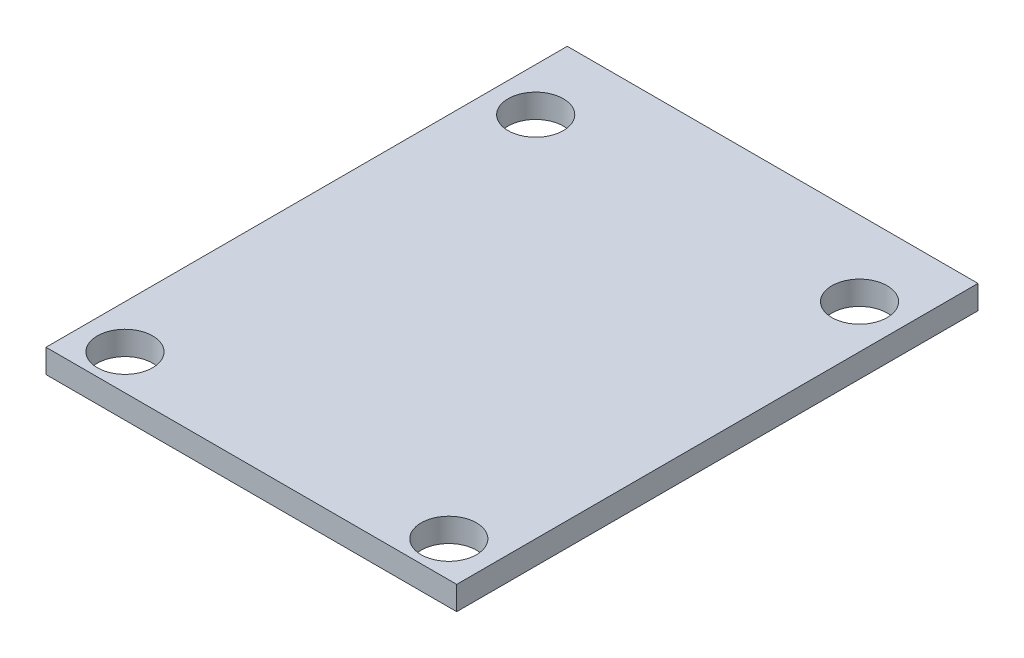
ISO-10303-21;
HEADER;
FILE_DESCRIPTION(('STEP AP214'),'2;1');
FILE_NAME('part.step','',(''),(''),'','','');
FILE_SCHEMA(('AUTOMOTIVE_DESIGN { 1 0 10303 214 1 1 1 1 }'));
ENDSEC;
DATA;
#1=APPLICATION_CONTEXT('core data for automotive mechanical design processes');
#2=APPLICATION_PROTOCOL_DEFINITION('international standard','automotive_design',2000,#1);
#3=PRODUCT_CONTEXT('',#1,'mechanical');
#4=PRODUCT('Part','Part','',(#3));
#5=PRODUCT_RELATED_PRODUCT_CATEGORY('part','',(#4));
#6=PRODUCT_DEFINITION_FORMATION('','',#4);
#7=PRODUCT_DEFINITION_CONTEXT('part definition',#1,'design');
#8=PRODUCT_DEFINITION('design','',#6,#7);
#9=PRODUCT_DEFINITION_SHAPE('','',#8);
#10=(LENGTH_UNIT() NAMED_UNIT(*) SI_UNIT(.MILLI.,.METRE.));
#11=(NAMED_UNIT(*) PLANE_ANGLE_UNIT() SI_UNIT($,.RADIAN.));
#12=(NAMED_UNIT(*) SI_UNIT($,.STERADIAN.) SOLID_ANGLE_UNIT());
#13=UNCERTAINTY_MEASURE_WITH_UNIT(LENGTH_MEASURE(1.E-05),#10,'distance_accuracy_value','');
#14=(GEOMETRIC_REPRESENTATION_CONTEXT(3) GLOBAL_UNCERTAINTY_ASSIGNED_CONTEXT((#13)) GLOBAL_UNIT_ASSIGNED_CONTEXT((#10,
#11,#12)) REPRESENTATION_CONTEXT('',''));
#15=CARTESIAN_POINT('',(0.,0.,0.));
#16=DIRECTION('',(0.,0.,1.));
#17=DIRECTION('',(1.,0.,0.));
#18=AXIS2_PLACEMENT_3D('',#15,#16,#17);
#19=CARTESIAN_POINT('',(13.,1.5,0.));
#20=DIRECTION('',(1.,0.,0.));
#21=DIRECTION('',(0.,0.,-1.));
#22=AXIS2_PLACEMENT_3D('',#19,#20,#21);
#23=PLANE('',#22);
#24=DIRECTION('',(0.,0.,1.));
#25=VECTOR('',#24,1.);
#26=CARTESIAN_POINT('',(13.,0.,0.));
#27=LINE('',#26,#25);
#28=CARTESIAN_POINT('',(13.,0.,-16.5));
#29=VERTEX_POINT('',#28);
#30=CARTESIAN_POINT('',(13.,0.,16.5));
#31=VERTEX_POINT('',#30);
#32=EDGE_CURVE('E117',#29,#31,#27,.T.);
#33=ORIENTED_EDGE('',*,*,#32,.F.);
#34=DIRECTION('',(0.,-1.,0.));
#35=VECTOR('',#34,1.);
#36=CARTESIAN_POINT('',(13.,1.5,-16.5));
#37=LINE('',#36,#35);
#38=CARTESIAN_POINT('',(13.,1.5,-16.5));
#39=VERTEX_POINT('',#38);
#40=EDGE_CURVE('E11',#39,#29,#37,.T.);
#41=ORIENTED_EDGE('',*,*,#40,.F.);
#42=DIRECTION('',(0.,0.,1.));
#43=VECTOR('',#42,1.);
#44=CARTESIAN_POINT('',(13.,1.5,0.));
#45=LINE('',#44,#43);
#46=CARTESIAN_POINT('',(13.,1.5,16.5));
#47=VERTEX_POINT('',#46);
#48=EDGE_CURVE('E98',#39,#47,#45,.T.);
#49=ORIENTED_EDGE('',*,*,#48,.T.);
#50=DIRECTION('',(0.,-1.,0.));
#51=VECTOR('',#50,1.);
#52=CARTESIAN_POINT('',(13.,1.5,16.5));
#53=LINE('',#52,#51);
#54=EDGE_CURVE('E77',#47,#31,#53,.T.);
#55=ORIENTED_EDGE('',*,*,#54,.T.);
#56=EDGE_LOOP('',(#33,#41,#49,#55));
#57=FACE_BOUND('',#56,.T.);
#58=ADVANCED_FACE('F37',(#57),#23,.T.);
#59=CARTESIAN_POINT('',(0.,1.5,-16.5));
#60=DIRECTION('',(0.,0.,-1.));
#61=DIRECTION('',(-1.,0.,0.));
#62=AXIS2_PLACEMENT_3D('',#59,#60,#61);
#63=PLANE('',#62);
#64=DIRECTION('',(1.,0.,0.));
#65=VECTOR('',#64,1.);
#66=CARTESIAN_POINT('',(0.,0.,-16.5));
#67=LINE('',#66,#65);
#68=CARTESIAN_POINT('',(-13.,0.,-16.5));
#69=VERTEX_POINT('',#68);
#70=EDGE_CURVE('E89',#69,#29,#67,.T.);
#71=ORIENTED_EDGE('',*,*,#70,.F.);
#72=DIRECTION('',(0.,-1.,0.));
#73=VECTOR('',#72,1.);
#74=CARTESIAN_POINT('',(-13.,1.5,-16.5));
#75=LINE('',#74,#73);
#76=CARTESIAN_POINT('',(-13.,1.5,-16.5));
#77=VERTEX_POINT('',#76);
#78=EDGE_CURVE('E46',#77,#69,#75,.T.);
#79=ORIENTED_EDGE('',*,*,#78,.F.);
#80=DIRECTION('',(1.,0.,0.));
#81=VECTOR('',#80,1.);
#82=CARTESIAN_POINT('',(0.,1.5,-16.5));
#83=LINE('',#82,#81);
#84=EDGE_CURVE('E87',#77,#39,#83,.T.);
#85=ORIENTED_EDGE('',*,*,#84,.T.);
#86=ORIENTED_EDGE('',*,*,#40,.T.);
#87=EDGE_LOOP('',(#71,#79,#85,#86));
#88=FACE_BOUND('',#87,.T.);
#89=ADVANCED_FACE('F85',(#88),#63,.T.);
#90=CARTESIAN_POINT('',(-13.,1.5,0.));
#91=DIRECTION('',(1.,0.,0.));
#92=DIRECTION('',(0.,0.,-1.));
#93=AXIS2_PLACEMENT_3D('',#90,#91,#92);
#94=PLANE('',#93);
#95=DIRECTION('',(0.,0.,1.));
#96=VECTOR('',#95,1.);
#97=CARTESIAN_POINT('',(-13.,0.,0.));
#98=LINE('',#97,#96);
#99=CARTESIAN_POINT('',(-13.,0.,16.5));
#100=VERTEX_POINT('',#99);
#101=EDGE_CURVE('E120',#69,#100,#98,.T.);
#102=ORIENTED_EDGE('',*,*,#101,.T.);
#103=DIRECTION('',(0.,-1.,0.));
#104=VECTOR('',#103,1.);
#105=CARTESIAN_POINT('',(-13.,1.5,16.5));
#106=LINE('',#105,#104);
#107=CARTESIAN_POINT('',(-13.,1.5,16.5));
#108=VERTEX_POINT('',#107);
#109=EDGE_CURVE('E92',#108,#100,#106,.T.);
#110=ORIENTED_EDGE('',*,*,#109,.F.);
#111=DIRECTION('',(0.,0.,1.));
#112=VECTOR('',#111,1.);
#113=CARTESIAN_POINT('',(-13.,1.5,0.));
#114=LINE('',#113,#112);
#115=EDGE_CURVE('E94',#77,#108,#114,.T.);
#116=ORIENTED_EDGE('',*,*,#115,.F.);
#117=ORIENTED_EDGE('',*,*,#78,.T.);
#118=EDGE_LOOP('',(#102,#110,#116,#117));
#119=FACE_BOUND('',#118,.T.);
#120=ADVANCED_FACE('F95',(#119),#94,.F.);
#121=CARTESIAN_POINT('',(-10.25,1.5,-11.75));
#122=DIRECTION('',(0.,-1.,0.));
#123=DIRECTION('',(0.,0.,-1.));
#124=AXIS2_PLACEMENT_3D('',#121,#122,#123);
#125=CYLINDRICAL_SURFACE('',#124,1.75);
#126=CARTESIAN_POINT('',(-10.25,1.5,-11.75));
#127=DIRECTION('',(0.,1.,0.));
#128=DIRECTION('',(0.,0.,1.));
#129=AXIS2_PLACEMENT_3D('',#126,#127,#128);
#130=CIRCLE('',#129,1.75);
#131=CARTESIAN_POINT('',(-10.25,1.5,-10.));
#132=VERTEX_POINT('',#131);
#133=EDGE_CURVE('E100',#132,#132,#130,.T.);
#134=ORIENTED_EDGE('',*,*,#133,.T.);
#135=EDGE_LOOP('',(#134));
#136=FACE_BOUND('',#135,.T.);
#137=CARTESIAN_POINT('',(-10.25,0.,-11.75));
#138=DIRECTION('',(0.,1.,0.));
#139=DIRECTION('',(0.,0.,1.));
#140=AXIS2_PLACEMENT_3D('',#137,#138,#139);
#141=CIRCLE('',#140,1.75);
#142=CARTESIAN_POINT('',(-10.25,0.,-10.));
#143=VERTEX_POINT('',#142);
#144=EDGE_CURVE('E114',#143,#143,#141,.T.);
#145=ORIENTED_EDGE('',*,*,#144,.F.);
#146=EDGE_LOOP('',(#145));
#147=FACE_BOUND('',#146,.T.);
#148=ADVANCED_FACE('F136',(#136,#147),#125,.F.);
#149=CARTESIAN_POINT('',(10.25,1.5,-11.75));
#150=DIRECTION('',(0.,-1.,0.));
#151=DIRECTION('',(0.,0.,-1.));
#152=AXIS2_PLACEMENT_3D('',#149,#150,#151);
#153=CYLINDRICAL_SURFACE('',#152,1.75);
#154=CARTESIAN_POINT('',(10.25,1.5,-11.75));
#155=DIRECTION('',(0.,1.,0.));
#156=DIRECTION('',(0.,0.,1.));
#157=AXIS2_PLACEMENT_3D('',#154,#155,#156);
#158=CIRCLE('',#157,1.75);
#159=CARTESIAN_POINT('',(10.25,1.5,-10.));
#160=VERTEX_POINT('',#159);
#161=EDGE_CURVE('E240',#160,#160,#158,.T.);
#162=ORIENTED_EDGE('',*,*,#161,.T.);
#163=EDGE_LOOP('',(#162));
#164=FACE_BOUND('',#163,.T.);
#165=CARTESIAN_POINT('',(10.25,0.,-11.75));
#166=DIRECTION('',(0.,1.,0.));
#167=DIRECTION('',(0.,0.,1.));
#168=AXIS2_PLACEMENT_3D('',#165,#166,#167);
#169=CIRCLE('',#168,1.75);
#170=CARTESIAN_POINT('',(10.25,0.,-10.));
#171=VERTEX_POINT('',#170);
#172=EDGE_CURVE('E111',#171,#171,#169,.T.);
#173=ORIENTED_EDGE('',*,*,#172,.F.);
#174=EDGE_LOOP('',(#173));
#175=FACE_BOUND('',#174,.T.);
#176=ADVANCED_FACE('F139',(#164,#175),#153,.F.);
#177=CARTESIAN_POINT('',(-10.25,1.5,14.25));
#178=DIRECTION('',(0.,-1.,0.));
#179=DIRECTION('',(0.,0.,-1.));
#180=AXIS2_PLACEMENT_3D('',#177,#178,#179);
#181=CYLINDRICAL_SURFACE('',#180,1.75);
#182=CARTESIAN_POINT('',(-10.25,1.5,14.25));
#183=DIRECTION('',(0.,1.,0.));
#184=DIRECTION('',(0.,0.,1.));
#185=AXIS2_PLACEMENT_3D('',#182,#183,#184);
#186=CIRCLE('',#185,1.75);
#187=CARTESIAN_POINT('',(-10.25,1.5,16.));
#188=VERTEX_POINT('',#187);
#189=EDGE_CURVE('E153',#188,#188,#186,.T.);
#190=ORIENTED_EDGE('',*,*,#189,.T.);
#191=EDGE_LOOP('',(#190));
#192=FACE_BOUND('',#191,.T.);
#193=CARTESIAN_POINT('',(-10.25,0.,14.25));
#194=DIRECTION('',(0.,1.,0.));
#195=DIRECTION('',(0.,0.,1.));
#196=AXIS2_PLACEMENT_3D('',#193,#194,#195);
#197=CIRCLE('',#196,1.75);
#198=CARTESIAN_POINT('',(-10.25,0.,16.));
#199=VERTEX_POINT('',#198);
#200=EDGE_CURVE('E108',#199,#199,#197,.T.);
#201=ORIENTED_EDGE('',*,*,#200,.F.);
#202=EDGE_LOOP('',(#201));
#203=FACE_BOUND('',#202,.T.);
#204=ADVANCED_FACE('F142',(#192,#203),#181,.F.);
#205=CARTESIAN_POINT('',(10.25,1.5,14.25));
#206=DIRECTION('',(0.,-1.,0.));
#207=DIRECTION('',(0.,0.,-1.));
#208=AXIS2_PLACEMENT_3D('',#205,#206,#207);
#209=CYLINDRICAL_SURFACE('',#208,1.75);
#210=CARTESIAN_POINT('',(10.25,1.5,14.25));
#211=DIRECTION('',(0.,1.,0.));
#212=DIRECTION('',(0.,0.,1.));
#213=AXIS2_PLACEMENT_3D('',#210,#211,#212);
#214=CIRCLE('',#213,1.75);
#215=CARTESIAN_POINT('',(10.25,1.5,16.));
#216=VERTEX_POINT('',#215);
#217=EDGE_CURVE('E123',#216,#216,#214,.T.);
#218=ORIENTED_EDGE('',*,*,#217,.T.);
#219=EDGE_LOOP('',(#218));
#220=FACE_BOUND('',#219,.T.);
#221=CARTESIAN_POINT('',(10.25,0.,14.25));
#222=DIRECTION('',(0.,1.,0.));
#223=DIRECTION('',(0.,0.,1.));
#224=AXIS2_PLACEMENT_3D('',#221,#222,#223);
#225=CIRCLE('',#224,1.75);
#226=CARTESIAN_POINT('',(10.25,0.,16.));
#227=VERTEX_POINT('',#226);
#228=EDGE_CURVE('E105',#227,#227,#225,.T.);
#229=ORIENTED_EDGE('',*,*,#228,.F.);
#230=EDGE_LOOP('',(#229));
#231=FACE_BOUND('',#230,.T.);
#232=ADVANCED_FACE('F39',(#220,#231),#209,.F.);
#233=CARTESIAN_POINT('',(0.,1.5,16.5));
#234=DIRECTION('',(0.,0.,-1.));
#235=DIRECTION('',(-1.,0.,0.));
#236=AXIS2_PLACEMENT_3D('',#233,#234,#235);
#237=PLANE('',#236);
#238=DIRECTION('',(1.,0.,0.));
#239=VECTOR('',#238,1.);
#240=CARTESIAN_POINT('',(0.,0.,16.5));
#241=LINE('',#240,#239);
#242=EDGE_CURVE('E70',#100,#31,#241,.T.);
#243=ORIENTED_EDGE('',*,*,#242,.T.);
#244=ORIENTED_EDGE('',*,*,#54,.F.);
#245=DIRECTION('',(1.,0.,0.));
#246=VECTOR('',#245,1.);
#247=CARTESIAN_POINT('',(0.,1.5,16.5));
#248=LINE('',#247,#246);
#249=EDGE_CURVE('E54',#108,#47,#248,.T.);
#250=ORIENTED_EDGE('',*,*,#249,.F.);
#251=ORIENTED_EDGE('',*,*,#109,.T.);
#252=EDGE_LOOP('',(#243,#244,#250,#251));
#253=FACE_BOUND('',#252,.T.);
#254=ADVANCED_FACE('F126',(#253),#237,.F.);
#255=CARTESIAN_POINT('',(0.,1.5,0.));
#256=DIRECTION('',(0.,1.,0.));
#257=DIRECTION('',(0.,0.,1.));
#258=AXIS2_PLACEMENT_3D('',#255,#256,#257);
#259=PLANE('',#258);
#260=ORIENTED_EDGE('',*,*,#217,.F.);
#261=EDGE_LOOP('',(#260));
#262=FACE_BOUND('',#261,.T.);
#263=ORIENTED_EDGE('',*,*,#189,.F.);
#264=EDGE_LOOP('',(#263));
#265=FACE_BOUND('',#264,.T.);
#266=ORIENTED_EDGE('',*,*,#161,.F.);
#267=EDGE_LOOP('',(#266));
#268=FACE_BOUND('',#267,.T.);
#269=ORIENTED_EDGE('',*,*,#133,.F.);
#270=EDGE_LOOP('',(#269));
#271=FACE_BOUND('',#270,.T.);
#272=ORIENTED_EDGE('',*,*,#48,.F.);
#273=ORIENTED_EDGE('',*,*,#84,.F.);
#274=ORIENTED_EDGE('',*,*,#115,.T.);
#275=ORIENTED_EDGE('',*,*,#249,.T.);
#276=EDGE_LOOP('',(#272,#273,#274,#275));
#277=FACE_BOUND('',#276,.T.);
#278=ADVANCED_FACE('F97',(#262,#265,#268,#271,#277),#259,.T.);
#279=CARTESIAN_POINT('',(0.,0.,0.));
#280=DIRECTION('',(0.,1.,0.));
#281=DIRECTION('',(0.,0.,1.));
#282=AXIS2_PLACEMENT_3D('',#279,#280,#281);
#283=PLANE('',#282);
#284=ORIENTED_EDGE('',*,*,#228,.T.);
#285=EDGE_LOOP('',(#284));
#286=FACE_BOUND('',#285,.T.);
#287=ORIENTED_EDGE('',*,*,#200,.T.);
#288=EDGE_LOOP('',(#287));
#289=FACE_BOUND('',#288,.T.);
#290=ORIENTED_EDGE('',*,*,#172,.T.);
#291=EDGE_LOOP('',(#290));
#292=FACE_BOUND('',#291,.T.);
#293=ORIENTED_EDGE('',*,*,#144,.T.);
#294=EDGE_LOOP('',(#293));
#295=FACE_BOUND('',#294,.T.);
#296=ORIENTED_EDGE('',*,*,#32,.T.);
#297=ORIENTED_EDGE('',*,*,#242,.F.);
#298=ORIENTED_EDGE('',*,*,#101,.F.);
#299=ORIENTED_EDGE('',*,*,#70,.T.);
#300=EDGE_LOOP('',(#296,#297,#298,#299));
#301=FACE_BOUND('',#300,.T.);
#302=ADVANCED_FACE('F127',(#286,#289,#292,#295,#301),#283,.F.);
#303=CLOSED_SHELL('',(#58,#89,#120,#148,#176,#204,#232,#254,#278,#302));
#304=MANIFOLD_SOLID_BREP('B2',#303);
#305=ADVANCED_BREP_SHAPE_REPRESENTATION('',(#18,#304),#14);
#306=SHAPE_DEFINITION_REPRESENTATION(#9,#305);
ENDSEC;
END-ISO-10303-21;
